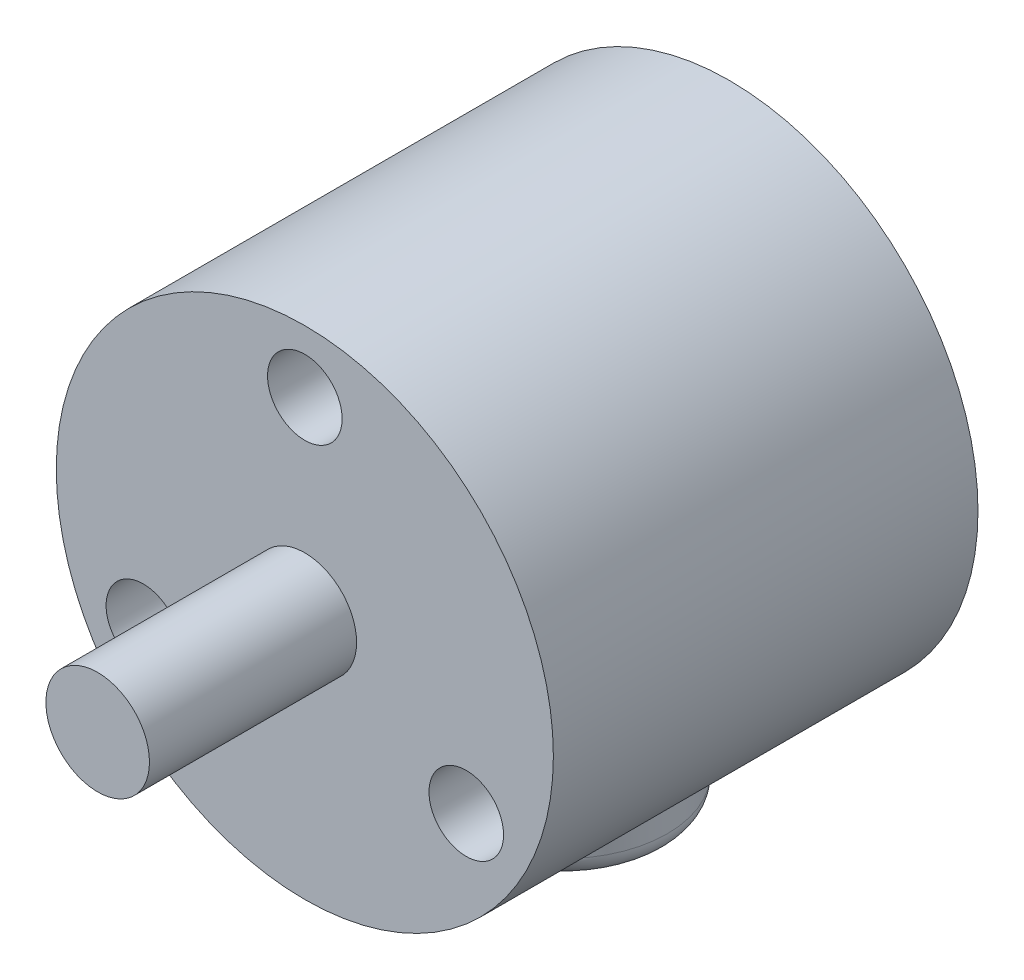
ISO-10303-21;
HEADER;
FILE_DESCRIPTION(('STEP AP214'),'2;1');
FILE_NAME('part.step','',(''),(''),'','','');
FILE_SCHEMA(('AUTOMOTIVE_DESIGN { 1 0 10303 214 1 1 1 1 }'));
ENDSEC;
DATA;
#1=APPLICATION_CONTEXT('core data for automotive mechanical design processes');
#2=APPLICATION_PROTOCOL_DEFINITION('international standard','automotive_design',2000,#1);
#3=PRODUCT_CONTEXT('',#1,'mechanical');
#4=PRODUCT('Part','Part','',(#3));
#5=PRODUCT_RELATED_PRODUCT_CATEGORY('part','',(#4));
#6=PRODUCT_DEFINITION_FORMATION('','',#4);
#7=PRODUCT_DEFINITION_CONTEXT('part definition',#1,'design');
#8=PRODUCT_DEFINITION('design','',#6,#7);
#9=PRODUCT_DEFINITION_SHAPE('','',#8);
#10=(LENGTH_UNIT() NAMED_UNIT(*) SI_UNIT(.MILLI.,.METRE.));
#11=(NAMED_UNIT(*) PLANE_ANGLE_UNIT() SI_UNIT($,.RADIAN.));
#12=(NAMED_UNIT(*) SI_UNIT($,.STERADIAN.) SOLID_ANGLE_UNIT());
#13=UNCERTAINTY_MEASURE_WITH_UNIT(LENGTH_MEASURE(1.E-05),#10,'distance_accuracy_value','');
#14=(GEOMETRIC_REPRESENTATION_CONTEXT(3) GLOBAL_UNCERTAINTY_ASSIGNED_CONTEXT((#13)) GLOBAL_UNIT_ASSIGNED_CONTEXT((#10,
#11,#12)) REPRESENTATION_CONTEXT('',''));
#15=CARTESIAN_POINT('',(0.,0.,0.));
#16=DIRECTION('',(0.,0.,1.));
#17=DIRECTION('',(1.,0.,0.));
#18=AXIS2_PLACEMENT_3D('',#15,#16,#17);
#19=CARTESIAN_POINT('',(0.,0.,20.5));
#20=DIRECTION('',(0.,0.,-1.));
#21=DIRECTION('',(-1.,0.,0.));
#22=AXIS2_PLACEMENT_3D('',#19,#20,#21);
#23=CYLINDRICAL_SURFACE('',#22,12.);
#24=CARTESIAN_POINT('',(0.,-12.,13.));
#25=CARTESIAN_POINT('',(0.133971202199808,-11.9999992729584,12.9999990914666));
#26=CARTESIAN_POINT('',(0.267987722487516,-11.9977503193947,12.9946081945841));
#27=CARTESIAN_POINT('',(0.535066499257948,-11.9888105832946,12.9730948474972));
#28=CARTESIAN_POINT('',(0.668128097998224,-11.9821169900031,12.956965606432));
#29=CARTESIAN_POINT('',(0.932528423558352,-11.9644464126044,12.9140981034186));
#30=CARTESIAN_POINT('',(1.06386304519886,-11.9534606492307,12.8873380952507));
#31=CARTESIAN_POINT('',(1.32363712069101,-11.927490817702,12.8234725282148));
#32=CARTESIAN_POINT('',(1.45207536803167,-11.9125051155232,12.7863627410574));
#33=CARTESIAN_POINT('',(1.70466599018599,-11.8789846295891,12.7023138952485));
#34=CARTESIAN_POINT('',(1.82883288573375,-11.8604636474237,12.6554129961059));
#35=CARTESIAN_POINT('',(2.07264264011727,-11.8202983493247,12.5521104896258));
#36=CARTESIAN_POINT('',(2.19228378684376,-11.7986528660016,12.4957053299424));
#37=CARTESIAN_POINT('',(2.54317702528674,-11.7298276864823,12.3129628809401));
#38=CARTESIAN_POINT('',(2.76673759984579,-11.6787121912958,12.1729849898133));
#39=CARTESIAN_POINT('',(3.19782871405717,-11.5683104696206,11.8534779348464));
#40=CARTESIAN_POINT('',(3.40415336067112,-11.5087569814803,11.672428921225));
#41=CARTESIAN_POINT('',(3.78465099990966,-11.3893017107102,11.2789084865618));
#42=CARTESIAN_POINT('',(3.95880706375339,-11.3293997617084,11.0664206260931));
#43=CARTESIAN_POINT('',(4.19642716763638,-11.2426693606487,10.722276329291));
#44=CARTESIAN_POINT('',(4.27318721758388,-11.213641472833,10.6001426427212));
#45=CARTESIAN_POINT('',(4.41607485285565,-11.158142646463,10.3492739587432));
#46=CARTESIAN_POINT('',(4.48220683770539,-11.1316706517088,10.2205417220864));
#47=CARTESIAN_POINT('',(4.60326824362323,-11.0821570819096,9.95727380138148));
#48=CARTESIAN_POINT('',(4.65819717388443,-11.0591156571702,9.82273786338529));
#49=CARTESIAN_POINT('',(4.75627631879271,-11.0172900479988,9.54886247889822));
#50=CARTESIAN_POINT('',(4.79943258893619,-10.9985036757451,9.40952554359407));
#51=CARTESIAN_POINT('',(4.87173603809854,-10.9666619504758,9.13380805072207));
#52=CARTESIAN_POINT('',(4.90145340480219,-10.9533759137281,8.99760365958737));
#53=CARTESIAN_POINT('',(4.94943501929704,-10.9317788095431,8.72286059838521));
#54=CARTESIAN_POINT('',(4.96770456006234,-10.9234654430414,8.58432303754408));
#55=CARTESIAN_POINT('',(4.9925806714702,-10.9121183161802,8.30602414623231));
#56=CARTESIAN_POINT('',(4.99919025060126,-10.9090831939376,8.16626314078902));
#57=CARTESIAN_POINT('',(5.00066965421038,-10.9084052474415,7.88666968828848));
#58=CARTESIAN_POINT('',(4.99554009665008,-10.9107621393462,7.74683724537919));
#59=CARTESIAN_POINT('',(4.97445537231527,-10.9203897344954,7.47901464805327));
#60=CARTESIAN_POINT('',(4.95936366570947,-10.9272683387031,7.35094126629261));
#61=CARTESIAN_POINT('',(4.91939456846064,-10.9453203456551,7.09659754142487));
#62=CARTESIAN_POINT('',(4.89451397815816,-10.9564951526574,6.97032780186761));
#63=CARTESIAN_POINT('',(4.83521901523602,-10.982791432776,6.72049574743192));
#64=CARTESIAN_POINT('',(4.80080681510625,-10.9979120065088,6.59693282252032));
#65=CARTESIAN_POINT('',(4.72276746407086,-11.0316484281794,6.353225711498));
#66=CARTESIAN_POINT('',(4.67913676011188,-11.0502656234987,6.23308286389346));
#67=CARTESIAN_POINT('',(4.53292198464472,-11.1114348958982,5.87391306752255));
#68=CARTESIAN_POINT('',(4.41623317355433,-11.1587355468125,5.64125821268693));
#69=CARTESIAN_POINT('',(4.14923538558579,-11.2607369782698,5.19804915238382));
#70=CARTESIAN_POINT('',(3.99891315023541,-11.315440673762,4.98750371078817));
#71=CARTESIAN_POINT('',(3.65399862437446,-11.4317164413063,4.57561717753678));
#72=CARTESIAN_POINT('',(3.4567386368719,-11.4934782659376,4.37655771261506));
#73=CARTESIAN_POINT('',(3.0308736497062,-11.6130335162842,4.01352200039607));
#74=CARTESIAN_POINT('',(2.80226132798022,-11.6708260102514,3.84955397136795));
#75=CARTESIAN_POINT('',(2.43728165238545,-11.750564458423,3.63188502116149));
#76=CARTESIAN_POINT('',(2.31032222862648,-11.7762436004382,3.56341446300228));
#77=CARTESIAN_POINT('',(2.05046026272765,-11.8242558878425,3.43749802283573));
#78=CARTESIAN_POINT('',(1.91756015985751,-11.8465903904629,3.38004766623415));
#79=CARTESIAN_POINT('',(1.64677309924856,-11.8872573475038,3.27674472498626));
#80=CARTESIAN_POINT('',(1.50888729966569,-11.9055907244947,3.23088946638133));
#81=CARTESIAN_POINT('',(1.22915368100483,-11.9377129809443,3.15125570058601));
#82=CARTESIAN_POINT('',(1.08730616375715,-11.951502205588,3.11747627606863));
#83=CARTESIAN_POINT('',(0.809887683545695,-11.9733956498248,3.06413586262167));
#84=CARTESIAN_POINT('',(0.674487262769715,-11.981804303078,3.04381063945912));
#85=CARTESIAN_POINT('',(0.402272400346696,-11.9940291261992,3.01432893966274));
#86=CARTESIAN_POINT('',(0.26545803644642,-11.9978455472339,3.00517185220077));
#87=CARTESIAN_POINT('',(-0.00847703491070739,-12.0007785959499,2.99813065484733));
#88=CARTESIAN_POINT('',(-0.145597660207647,-11.9998963609136,3.00024381705729));
#89=CARTESIAN_POINT('',(-0.419090564387011,-11.993459536273,3.01571255277727));
#90=CARTESIAN_POINT('',(-0.555462859843409,-11.9879050505733,3.02906787627665));
#91=CARTESIAN_POINT('',(-0.819630607320878,-11.9726701367381,3.06592509226874));
#92=CARTESIAN_POINT('',(-0.94751451423134,-11.9632093877852,3.08888750454916));
#93=CARTESIAN_POINT('',(-1.20082196325612,-11.940444106674,3.14460593564766));
#94=CARTESIAN_POINT('',(-1.3262446899797,-11.9271383228689,3.17736514366791));
#95=CARTESIAN_POINT('',(-1.57375204172412,-11.8970094891313,3.25236741168871));
#96=CARTESIAN_POINT('',(-1.69583759693526,-11.8801874308528,3.29460779807032));
#97=CARTESIAN_POINT('',(-1.93599084783536,-11.8434257462031,3.38821332811291));
#98=CARTESIAN_POINT('',(-2.05405699265853,-11.8234849327137,3.43958194734866));
#99=CARTESIAN_POINT('',(-2.40829498205295,-11.758346790855,3.61023048200071));
#100=CARTESIAN_POINT('',(-2.63698994915988,-11.7087843162294,3.74377555233129));
#101=CARTESIAN_POINT('',(-3.06942387949653,-11.6029475237576,4.04423069860453));
#102=CARTESIAN_POINT('',(-3.27315236592591,-11.5466704076328,4.21115470470482));
#103=CARTESIAN_POINT('',(-3.66531769677002,-11.4284863692559,4.58759654117524));
#104=CARTESIAN_POINT('',(-3.85162119447865,-11.3664645360616,4.79930583321336));
#105=CARTESIAN_POINT('',(-4.18670098676195,-11.2473669968316,5.25213329340222));
#106=CARTESIAN_POINT('',(-4.33546875898715,-11.1902924159789,5.49325812184049));
#107=CARTESIAN_POINT('',(-4.52791722204378,-11.1131825672233,5.8742799790697));
#108=CARTESIAN_POINT('',(-4.58727880369506,-11.0887445801545,6.00557844323251));
#109=CARTESIAN_POINT('',(-4.69462511155256,-11.0437261293759,6.27336529062487));
#110=CARTESIAN_POINT('',(-4.74261484462541,-11.0231439688385,6.40985135899436));
#111=CARTESIAN_POINT('',(-4.82668853878451,-10.9865909853452,6.68697231949228));
#112=CARTESIAN_POINT('',(-4.86277797828965,-10.9706180409148,6.82760526998631));
#113=CARTESIAN_POINT('',(-4.92264916938559,-10.9438843614028,7.11195411229506));
#114=CARTESIAN_POINT('',(-4.94643207850299,-10.9331231361237,7.25566971283738));
#115=CARTESIAN_POINT('',(-4.9800298567505,-10.9178575324529,7.53376050190687));
#116=CARTESIAN_POINT('',(-4.99078127149666,-10.9129342806299,7.66800030408615));
#117=CARTESIAN_POINT('',(-5.00141640257177,-10.9080644511076,7.93704951835245));
#118=CARTESIAN_POINT('',(-5.00129648146308,-10.9081195391098,8.07185910599751));
#119=CARTESIAN_POINT('',(-4.99018296923951,-10.9132080645731,8.34086161118506));
#120=CARTESIAN_POINT('',(-4.97919509044956,-10.9182388867303,8.47505481548039));
#121=CARTESIAN_POINT('',(-4.94647921783658,-10.933099505538,8.74190431694874));
#122=CARTESIAN_POINT('',(-4.92474717591724,-10.9429311109705,8.87456001553816));
#123=CARTESIAN_POINT('',(-4.87205259520336,-10.966489611938,9.13112051872267));
#124=CARTESIAN_POINT('',(-4.84157230887098,-10.9800115342469,9.25514344248263));
#125=CARTESIAN_POINT('',(-4.77136925956337,-11.0106991045504,9.50009782053465));
#126=CARTESIAN_POINT('',(-4.73164330745016,-11.0278660096413,9.62102819209136));
#127=CARTESIAN_POINT('',(-4.59908761582496,-11.0841175717513,9.97806154942845));
#128=CARTESIAN_POINT('',(-4.49284253561317,-11.1279707524951,10.2085872556077));
#129=CARTESIAN_POINT('',(-4.24040889849447,-11.226679213664,10.6628156060107));
#130=CARTESIAN_POINT('',(-4.09220273518373,-11.2820374827937,10.8852745547109));
#131=CARTESIAN_POINT('',(-3.76270798192949,-11.396154190208,11.3034553285329));
#132=CARTESIAN_POINT('',(-3.58140792090314,-11.4549138026364,11.499167841482));
#133=CARTESIAN_POINT('',(-3.28060198965565,-11.5433831914863,11.7759891123433));
#134=CARTESIAN_POINT('',(-3.17135125699736,-11.5739466268846,11.8682042514757));
#135=CARTESIAN_POINT('',(-2.94510913832992,-11.6335718153871,12.0431112048865));
#136=CARTESIAN_POINT('',(-2.82812052219569,-11.6626340992841,12.1258063982126));
#137=CARTESIAN_POINT('',(-2.58697642479179,-11.7184848881627,12.281138652427));
#138=CARTESIAN_POINT('',(-2.46281438535245,-11.7452712553474,12.3537662962983));
#139=CARTESIAN_POINT('',(-2.2082535237545,-11.7957806454889,12.4882427852065));
#140=CARTESIAN_POINT('',(-2.07785761247781,-11.8195050794223,12.5500965995833));
#141=CARTESIAN_POINT('',(-1.81380017769054,-11.8628724264483,12.6615810427001));
#142=CARTESIAN_POINT('',(-1.68022444756869,-11.8825746428453,12.7113916311525));
#143=CARTESIAN_POINT('',(-1.40886045780292,-11.9177941454219,12.7995260141615));
#144=CARTESIAN_POINT('',(-1.27107423050946,-11.9333134162086,12.8378552570307));
#145=CARTESIAN_POINT('',(-0.992651980203959,-11.959688566513,12.9025525244881));
#146=CARTESIAN_POINT('',(-0.852023905428952,-11.9705559590045,12.9289500880649));
#147=CARTESIAN_POINT('',(-0.56880246605397,-11.9873498855457,12.9695979090313));
#148=CARTESIAN_POINT('',(-0.426210622389143,-11.9932800463356,12.9838570830855));
#149=CARTESIAN_POINT('',(-0.236110915428313,-11.9977699594236,12.9946457709799));
#150=CARTESIAN_POINT('',(-0.188916808355246,-11.9986057728967,12.9966530624495));
#151=CARTESIAN_POINT('',(-0.0944836795338208,-11.9997209221766,12.9993303390705));
#152=CARTESIAN_POINT('',(-0.0472446576572318,-12.0000002563897,13.0000003203924));
#153=CARTESIAN_POINT('',(0.,-12.,13.));
#154=B_SPLINE_CURVE_WITH_KNOTS('',3,(#24,#25,#26,#27,#28,#29,#30,#31,#32,#33,#34,#35,#36,#37,
#38,#39,#40,#41,#42,#43,#44,#45,#46,#47,#48,#49,#50,#51,#52,#53,#54,#55,#56,#57,#58,#59,#60,#61,
#62,#63,#64,#65,#66,#67,#68,#69,#70,#71,#72,#73,#74,#75,#76,#77,#78,#79,#80,#81,#82,#83,#84,#85,
#86,#87,#88,#89,#90,#91,#92,#93,#94,#95,#96,#97,#98,#99,#100,#101,#102,#103,#104,#105,#106,#107,
#108,#109,#110,#111,#112,#113,#114,#115,#116,#117,#118,#119,#120,#121,#122,#123,#124,#125,#126,
#127,#128,#129,#130,#131,#132,#133,#134,#135,#136,#137,#138,#139,#140,#141,#142,#143,#144,#145,
#146,#147,#148,#149,#150,#151,#152,#153),.UNSPECIFIED.,.T.,.F.,(4,2,2,2,2,2,2,2,2,2,2,2,2,2,2,2,
2,2,2,2,2,2,2,2,2,2,2,2,2,2,2,2,2,2,2,2,2,2,2,2,2,2,2,2,2,2,2,2,2,2,2,2,2,2,2,2,2,2,2,2,2,2,2,2,
4),(0.,0.401865511192765,0.803985401292742,1.20693213583696,1.61004373163513,2.01161264408377,
2.41333198262602,3.21570232241271,4.05488202655309,4.89450210025943,5.33547541815659,
5.77626572075065,6.21707533026384,6.657657771416,7.07721787938552,7.49658385769289,
7.91584161588806,8.33507730438084,8.72205078978925,9.10915086914489,9.49616279130698,
9.88332415102038,10.6733254842805,11.4636387906201,12.3207426070477,13.1780469345154,
13.6171124056289,14.0559992214016,14.4947847324951,14.9335369046603,15.3445355807386,
15.755511776716,16.1663885028034,16.5772560917832,16.9676245545711,17.3581202346347,
17.7485059359724,18.1390405964013,18.9435709432164,19.7484377511098,20.6108250535017,
21.4734079819436,21.911378276108,22.3491553782635,22.7867306630771,23.2242647829867,
23.6280231699892,24.0319166509118,24.435597953478,24.8394314677677,25.2242700123875,
25.6092414978881,26.3786352973221,27.1942912351952,28.0102304363353,28.4483841335548,
28.8863818280895,29.3247864929416,29.7629884086909,30.1941695396216,30.6251457342279,
31.0550490470869,31.4846362867339,31.6263528931453,31.7680699053748),.UNSPECIFIED.);
#155=CARTESIAN_POINT('',(0.,-12.,13.));
#156=VERTEX_POINT('',#155);
#157=EDGE_CURVE('E56',#156,#156,#154,.T.);
#158=ORIENTED_EDGE('',*,*,#157,.T.);
#159=EDGE_LOOP('',(#158));
#160=FACE_BOUND('',#159,.T.);
#161=CARTESIAN_POINT('',(0.,0.,20.5));
#162=DIRECTION('',(0.,0.,1.));
#163=DIRECTION('',(1.,0.,0.));
#164=AXIS2_PLACEMENT_3D('',#161,#162,#163);
#165=CIRCLE('',#164,12.);
#166=CARTESIAN_POINT('',(12.,0.,20.5));
#167=VERTEX_POINT('',#166);
#168=EDGE_CURVE('E53',#167,#167,#165,.T.);
#169=ORIENTED_EDGE('',*,*,#168,.F.);
#170=EDGE_LOOP('',(#169));
#171=FACE_BOUND('',#170,.T.);
#172=CARTESIAN_POINT('',(0.,0.,0.));
#173=DIRECTION('',(0.,0.,1.));
#174=DIRECTION('',(1.,0.,0.));
#175=AXIS2_PLACEMENT_3D('',#172,#173,#174);
#176=CIRCLE('',#175,12.);
#177=CARTESIAN_POINT('',(12.,0.,0.));
#178=VERTEX_POINT('',#177);
#179=EDGE_CURVE('E64',#178,#178,#176,.T.);
#180=ORIENTED_EDGE('',*,*,#179,.T.);
#181=EDGE_LOOP('',(#180));
#182=FACE_BOUND('',#181,.T.);
#183=ADVANCED_FACE('F38',(#160,#171,#182),#23,.T.);
#184=CARTESIAN_POINT('',(0.,0.,20.5));
#185=DIRECTION('',(0.,0.,1.));
#186=DIRECTION('',(1.,0.,0.));
#187=AXIS2_PLACEMENT_3D('',#184,#185,#186);
#188=PLANE('',#187);
#189=CARTESIAN_POINT('',(-7.79422863405991,-4.50000000000006,20.5));
#190=DIRECTION('',(0.,0.,1.));
#191=DIRECTION('',(1.,0.,0.));
#192=AXIS2_PLACEMENT_3D('',#189,#190,#191);
#193=CIRCLE('',#192,1.8);
#194=CARTESIAN_POINT('',(-5.99422863405991,-4.50000000000006,20.5));
#195=VERTEX_POINT('',#194);
#196=EDGE_CURVE('E127',#195,#195,#193,.T.);
#197=ORIENTED_EDGE('',*,*,#196,.F.);
#198=EDGE_LOOP('',(#197));
#199=FACE_BOUND('',#198,.T.);
#200=CARTESIAN_POINT('',(7.79422863405994,-4.50000000000001,20.5));
#201=DIRECTION('',(0.,0.,1.));
#202=DIRECTION('',(1.,0.,0.));
#203=AXIS2_PLACEMENT_3D('',#200,#201,#202);
#204=CIRCLE('',#203,1.8);
#205=CARTESIAN_POINT('',(9.59422863405994,-4.50000000000001,20.5));
#206=VERTEX_POINT('',#205);
#207=EDGE_CURVE('E137',#206,#206,#204,.T.);
#208=ORIENTED_EDGE('',*,*,#207,.F.);
#209=EDGE_LOOP('',(#208));
#210=FACE_BOUND('',#209,.T.);
#211=CARTESIAN_POINT('',(0.,9.,20.5));
#212=DIRECTION('',(0.,0.,1.));
#213=DIRECTION('',(1.,0.,0.));
#214=AXIS2_PLACEMENT_3D('',#211,#212,#213);
#215=CIRCLE('',#214,1.8);
#216=CARTESIAN_POINT('',(1.8,9.,20.5));
#217=VERTEX_POINT('',#216);
#218=EDGE_CURVE('E143',#217,#217,#215,.T.);
#219=ORIENTED_EDGE('',*,*,#218,.F.);
#220=EDGE_LOOP('',(#219));
#221=FACE_BOUND('',#220,.T.);
#222=CARTESIAN_POINT('',(0.,0.,20.5));
#223=DIRECTION('',(0.,0.,1.));
#224=DIRECTION('',(1.,0.,0.));
#225=AXIS2_PLACEMENT_3D('',#222,#223,#224);
#226=CIRCLE('',#225,2.5);
#227=CARTESIAN_POINT('',(2.5,0.,20.5));
#228=VERTEX_POINT('',#227);
#229=EDGE_CURVE('E49',#228,#228,#226,.T.);
#230=ORIENTED_EDGE('',*,*,#229,.F.);
#231=EDGE_LOOP('',(#230));
#232=FACE_BOUND('',#231,.T.);
#233=ORIENTED_EDGE('',*,*,#168,.T.);
#234=EDGE_LOOP('',(#233));
#235=FACE_BOUND('',#234,.T.);
#236=ADVANCED_FACE('F107',(#199,#210,#221,#232,#235),#188,.T.);
#237=CARTESIAN_POINT('',(0.,0.,0.));
#238=DIRECTION('',(0.,0.,1.));
#239=DIRECTION('',(1.,0.,0.));
#240=AXIS2_PLACEMENT_3D('',#237,#238,#239);
#241=PLANE('',#240);
#242=ORIENTED_EDGE('',*,*,#179,.F.);
#243=EDGE_LOOP('',(#242));
#244=FACE_BOUND('',#243,.T.);
#245=ADVANCED_FACE('F105',(#244),#241,.F.);
#246=CARTESIAN_POINT('',(0.,0.,24.));
#247=DIRECTION('',(0.,0.,-1.));
#248=DIRECTION('',(-1.,0.,0.));
#249=AXIS2_PLACEMENT_3D('',#246,#247,#248);
#250=CYLINDRICAL_SURFACE('',#249,2.5);
#251=ORIENTED_EDGE('',*,*,#229,.T.);
#252=EDGE_LOOP('',(#251));
#253=FACE_BOUND('',#252,.T.);
#254=CARTESIAN_POINT('',(0.,0.,30.5));
#255=DIRECTION('',(0.,0.,1.));
#256=DIRECTION('',(1.,0.,0.));
#257=AXIS2_PLACEMENT_3D('',#254,#255,#256);
#258=CIRCLE('',#257,2.5);
#259=CARTESIAN_POINT('',(2.5,0.,30.5));
#260=VERTEX_POINT('',#259);
#261=EDGE_CURVE('E63',#260,#260,#258,.T.);
#262=ORIENTED_EDGE('',*,*,#261,.F.);
#263=EDGE_LOOP('',(#262));
#264=FACE_BOUND('',#263,.T.);
#265=ADVANCED_FACE('F101',(#253,#264),#250,.T.);
#266=CARTESIAN_POINT('',(0.,9.,17.5));
#267=DIRECTION('',(0.,0.,1.));
#268=DIRECTION('',(1.,0.,0.));
#269=AXIS2_PLACEMENT_3D('',#266,#267,#268);
#270=CYLINDRICAL_SURFACE('',#269,1.8);
#271=CARTESIAN_POINT('',(0.,9.,17.5));
#272=DIRECTION('',(0.,0.,1.));
#273=DIRECTION('',(1.,0.,0.));
#274=AXIS2_PLACEMENT_3D('',#271,#272,#273);
#275=CIRCLE('',#274,1.8);
#276=CARTESIAN_POINT('',(1.8,9.,17.5));
#277=VERTEX_POINT('',#276);
#278=EDGE_CURVE('E140',#277,#277,#275,.T.);
#279=ORIENTED_EDGE('',*,*,#278,.F.);
#280=EDGE_LOOP('',(#279));
#281=FACE_BOUND('',#280,.T.);
#282=ORIENTED_EDGE('',*,*,#218,.T.);
#283=EDGE_LOOP('',(#282));
#284=FACE_BOUND('',#283,.T.);
#285=ADVANCED_FACE('F97',(#281,#284),#270,.F.);
#286=CARTESIAN_POINT('',(0.,0.,17.5));
#287=DIRECTION('',(0.,0.,1.));
#288=DIRECTION('',(1.,0.,0.));
#289=AXIS2_PLACEMENT_3D('',#286,#287,#288);
#290=PLANE('',#289);
#291=ORIENTED_EDGE('',*,*,#278,.T.);
#292=EDGE_LOOP('',(#291));
#293=FACE_BOUND('',#292,.T.);
#294=ADVANCED_FACE('F93',(#293),#290,.T.);
#295=CARTESIAN_POINT('',(7.79422863405994,-4.50000000000001,17.5));
#296=DIRECTION('',(0.,0.,1.));
#297=DIRECTION('',(1.,0.,0.));
#298=AXIS2_PLACEMENT_3D('',#295,#296,#297);
#299=CYLINDRICAL_SURFACE('',#298,1.8);
#300=CARTESIAN_POINT('',(7.79422863405994,-4.50000000000001,17.5));
#301=DIRECTION('',(0.,0.,1.));
#302=DIRECTION('',(1.,0.,0.));
#303=AXIS2_PLACEMENT_3D('',#300,#301,#302);
#304=CIRCLE('',#303,1.8);
#305=CARTESIAN_POINT('',(9.59422863405994,-4.50000000000001,17.5));
#306=VERTEX_POINT('',#305);
#307=EDGE_CURVE('E131',#306,#306,#304,.T.);
#308=ORIENTED_EDGE('',*,*,#307,.F.);
#309=EDGE_LOOP('',(#308));
#310=FACE_BOUND('',#309,.T.);
#311=ORIENTED_EDGE('',*,*,#207,.T.);
#312=EDGE_LOOP('',(#311));
#313=FACE_BOUND('',#312,.T.);
#314=ADVANCED_FACE('F89',(#310,#313),#299,.F.);
#315=CARTESIAN_POINT('',(0.,0.,17.5));
#316=DIRECTION('',(0.,0.,1.));
#317=DIRECTION('',(1.,0.,0.));
#318=AXIS2_PLACEMENT_3D('',#315,#316,#317);
#319=PLANE('',#318);
#320=ORIENTED_EDGE('',*,*,#307,.T.);
#321=EDGE_LOOP('',(#320));
#322=FACE_BOUND('',#321,.T.);
#323=ADVANCED_FACE('F85',(#322),#319,.T.);
#324=CARTESIAN_POINT('',(-7.79422863405991,-4.50000000000006,17.5));
#325=DIRECTION('',(0.,0.,1.));
#326=DIRECTION('',(1.,0.,0.));
#327=AXIS2_PLACEMENT_3D('',#324,#325,#326);
#328=CYLINDRICAL_SURFACE('',#327,1.8);
#329=CARTESIAN_POINT('',(-7.79422863405991,-4.50000000000006,17.5));
#330=DIRECTION('',(0.,0.,1.));
#331=DIRECTION('',(1.,0.,0.));
#332=AXIS2_PLACEMENT_3D('',#329,#330,#331);
#333=CIRCLE('',#332,1.8);
#334=CARTESIAN_POINT('',(-5.99422863405991,-4.50000000000006,17.5));
#335=VERTEX_POINT('',#334);
#336=EDGE_CURVE('E125',#335,#335,#333,.T.);
#337=ORIENTED_EDGE('',*,*,#336,.F.);
#338=EDGE_LOOP('',(#337));
#339=FACE_BOUND('',#338,.T.);
#340=ORIENTED_EDGE('',*,*,#196,.T.);
#341=EDGE_LOOP('',(#340));
#342=FACE_BOUND('',#341,.T.);
#343=ADVANCED_FACE('F81',(#339,#342),#328,.F.);
#344=CARTESIAN_POINT('',(0.,0.,17.5));
#345=DIRECTION('',(0.,0.,1.));
#346=DIRECTION('',(1.,0.,0.));
#347=AXIS2_PLACEMENT_3D('',#344,#345,#346);
#348=PLANE('',#347);
#349=ORIENTED_EDGE('',*,*,#336,.T.);
#350=EDGE_LOOP('',(#349));
#351=FACE_BOUND('',#350,.T.);
#352=ADVANCED_FACE('F77',(#351),#348,.T.);
#353=CARTESIAN_POINT('',(0.,0.,30.5));
#354=DIRECTION('',(0.,0.,1.));
#355=DIRECTION('',(1.,0.,0.));
#356=AXIS2_PLACEMENT_3D('',#353,#354,#355);
#357=PLANE('',#356);
#358=ORIENTED_EDGE('',*,*,#261,.T.);
#359=EDGE_LOOP('',(#358));
#360=FACE_BOUND('',#359,.T.);
#361=ADVANCED_FACE('F74',(#360),#357,.T.);
#362=CARTESIAN_POINT('',(0.,-14.,8.));
#363=DIRECTION('',(0.,1.,0.));
#364=DIRECTION('',(0.,0.,1.));
#365=AXIS2_PLACEMENT_3D('',#362,#363,#364);
#366=CYLINDRICAL_SURFACE('',#365,5.);
#367=CARTESIAN_POINT('',(0.,-13.,8.));
#368=DIRECTION('',(0.,1.,0.));
#369=DIRECTION('',(0.,0.,1.));
#370=AXIS2_PLACEMENT_3D('',#367,#368,#369);
#371=CIRCLE('',#370,5.);
#372=CARTESIAN_POINT('',(0.,-13.,13.));
#373=VERTEX_POINT('',#372);
#374=EDGE_CURVE('E45',#373,#373,#371,.T.);
#375=ORIENTED_EDGE('',*,*,#374,.T.);
#376=EDGE_LOOP('',(#375));
#377=FACE_BOUND('',#376,.T.);
#378=ORIENTED_EDGE('',*,*,#157,.F.);
#379=EDGE_LOOP('',(#378));
#380=FACE_BOUND('',#379,.T.);
#381=ADVANCED_FACE('F68',(#377,#380),#366,.T.);
#382=CARTESIAN_POINT('',(0.,-14.,8.));
#383=DIRECTION('',(0.,1.,0.));
#384=DIRECTION('',(0.,0.,1.));
#385=AXIS2_PLACEMENT_3D('',#382,#383,#384);
#386=PLANE('',#385);
#387=CARTESIAN_POINT('',(0.,-14.,8.));
#388=DIRECTION('',(0.,1.,0.));
#389=DIRECTION('',(0.,0.,1.));
#390=AXIS2_PLACEMENT_3D('',#387,#388,#389);
#391=CIRCLE('',#390,4.);
#392=CARTESIAN_POINT('',(0.,-14.,12.));
#393=VERTEX_POINT('',#392);
#394=EDGE_CURVE('E10',#393,#393,#391,.F.);
#395=ORIENTED_EDGE('',*,*,#394,.T.);
#396=EDGE_LOOP('',(#395));
#397=FACE_BOUND('',#396,.T.);
#398=ADVANCED_FACE('F73',(#397),#386,.F.);
#399=CARTESIAN_POINT('',(0.,-13.,8.));
#400=DIRECTION('',(0.,1.,0.));
#401=DIRECTION('',(0.,0.,1.));
#402=AXIS2_PLACEMENT_3D('',#399,#400,#401);
#403=TOROIDAL_SURFACE('',#402,4.,1.);
#404=ORIENTED_EDGE('',*,*,#394,.F.);
#405=EDGE_LOOP('',(#404));
#406=FACE_BOUND('',#405,.T.);
#407=ORIENTED_EDGE('',*,*,#374,.F.);
#408=EDGE_LOOP('',(#407));
#409=FACE_BOUND('',#408,.T.);
#410=ADVANCED_FACE('F40',(#406,#409),#403,.T.);
#411=CLOSED_SHELL('',(#183,#236,#245,#265,#285,#294,#314,#323,#343,#352,#361,#381,#398,#410));
#412=MANIFOLD_SOLID_BREP('B2',#411);
#413=ADVANCED_BREP_SHAPE_REPRESENTATION('',(#18,#412),#14);
#414=SHAPE_DEFINITION_REPRESENTATION(#9,#413);
ENDSEC;
END-ISO-10303-21;
